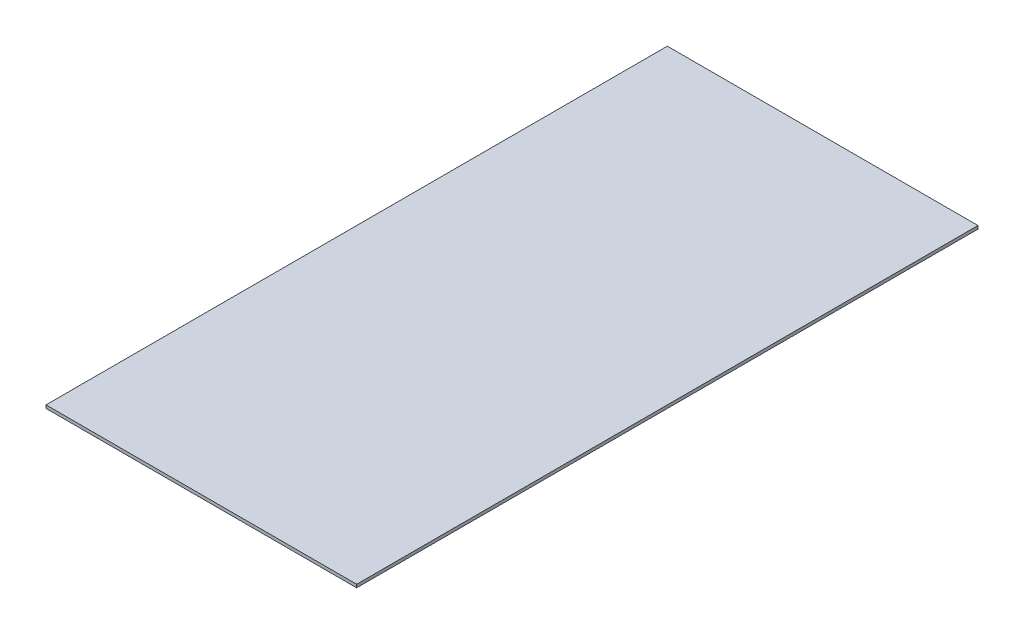
ISO-10303-21;
HEADER;
FILE_DESCRIPTION(('STEP AP214'),'2;1');
FILE_NAME('part.step','',(''),(''),'','','');
FILE_SCHEMA(('AUTOMOTIVE_DESIGN { 1 0 10303 214 1 1 1 1 }'));
ENDSEC;
DATA;
#1=APPLICATION_CONTEXT('core data for automotive mechanical design processes');
#2=APPLICATION_PROTOCOL_DEFINITION('international standard','automotive_design',2000,#1);
#3=PRODUCT_CONTEXT('',#1,'mechanical');
#4=PRODUCT('Part','Part','',(#3));
#5=PRODUCT_RELATED_PRODUCT_CATEGORY('part','',(#4));
#6=PRODUCT_DEFINITION_FORMATION('','',#4);
#7=PRODUCT_DEFINITION_CONTEXT('part definition',#1,'design');
#8=PRODUCT_DEFINITION('design','',#6,#7);
#9=PRODUCT_DEFINITION_SHAPE('','',#8);
#10=(LENGTH_UNIT() NAMED_UNIT(*) SI_UNIT(.MILLI.,.METRE.));
#11=(NAMED_UNIT(*) PLANE_ANGLE_UNIT() SI_UNIT($,.RADIAN.));
#12=(NAMED_UNIT(*) SI_UNIT($,.STERADIAN.) SOLID_ANGLE_UNIT());
#13=UNCERTAINTY_MEASURE_WITH_UNIT(LENGTH_MEASURE(1.E-05),#10,'distance_accuracy_value','');
#14=(GEOMETRIC_REPRESENTATION_CONTEXT(3) GLOBAL_UNCERTAINTY_ASSIGNED_CONTEXT((#13)) GLOBAL_UNIT_ASSIGNED_CONTEXT((#10,
#11,#12)) REPRESENTATION_CONTEXT('',''));
#15=CARTESIAN_POINT('',(0.,0.,0.));
#16=DIRECTION('',(0.,0.,1.));
#17=DIRECTION('',(1.,0.,0.));
#18=AXIS2_PLACEMENT_3D('',#15,#16,#17);
#19=CARTESIAN_POINT('',(-500.,-5.,1000.));
#20=DIRECTION('',(-1.,0.,0.));
#21=DIRECTION('',(0.,0.,1.));
#22=AXIS2_PLACEMENT_3D('',#19,#20,#21);
#23=PLANE('',#22);
#24=DIRECTION('',(0.,0.,1.));
#25=VECTOR('',#24,1.);
#26=CARTESIAN_POINT('',(-500.,5.,1000.));
#27=LINE('',#26,#25);
#28=CARTESIAN_POINT('',(-500.,5.,-1000.));
#29=VERTEX_POINT('',#28);
#30=CARTESIAN_POINT('',(-500.,5.,1000.));
#31=VERTEX_POINT('',#30);
#32=EDGE_CURVE('E97',#29,#31,#27,.T.);
#33=ORIENTED_EDGE('',*,*,#32,.F.);
#34=DIRECTION('',(0.,1.,0.));
#35=VECTOR('',#34,1.);
#36=CARTESIAN_POINT('',(-500.,-5.,-1000.));
#37=LINE('',#36,#35);
#38=CARTESIAN_POINT('',(-500.,-5.,-1000.));
#39=VERTEX_POINT('',#38);
#40=EDGE_CURVE('E11',#39,#29,#37,.T.);
#41=ORIENTED_EDGE('',*,*,#40,.F.);
#42=DIRECTION('',(0.,0.,1.));
#43=VECTOR('',#42,1.);
#44=CARTESIAN_POINT('',(-500.,-5.,1000.));
#45=LINE('',#44,#43);
#46=CARTESIAN_POINT('',(-500.,-5.,1000.));
#47=VERTEX_POINT('',#46);
#48=EDGE_CURVE('E91',#39,#47,#45,.T.);
#49=ORIENTED_EDGE('',*,*,#48,.T.);
#50=DIRECTION('',(0.,1.,0.));
#51=VECTOR('',#50,1.);
#52=CARTESIAN_POINT('',(-500.,-5.,1000.));
#53=LINE('',#52,#51);
#54=EDGE_CURVE('E36',#47,#31,#53,.T.);
#55=ORIENTED_EDGE('',*,*,#54,.T.);
#56=EDGE_LOOP('',(#33,#41,#49,#55));
#57=FACE_BOUND('',#56,.T.);
#58=ADVANCED_FACE('F33',(#57),#23,.T.);
#59=CARTESIAN_POINT('',(500.,-5.,-1000.));
#60=DIRECTION('',(0.,0.,-1.));
#61=DIRECTION('',(-1.,0.,0.));
#62=AXIS2_PLACEMENT_3D('',#59,#60,#61);
#63=PLANE('',#62);
#64=DIRECTION('',(-1.,0.,0.));
#65=VECTOR('',#64,1.);
#66=CARTESIAN_POINT('',(500.,5.,-1000.));
#67=LINE('',#66,#65);
#68=CARTESIAN_POINT('',(500.,5.,-1000.));
#69=VERTEX_POINT('',#68);
#70=EDGE_CURVE('E93',#69,#29,#67,.T.);
#71=ORIENTED_EDGE('',*,*,#70,.F.);
#72=DIRECTION('',(0.,1.,0.));
#73=VECTOR('',#72,1.);
#74=CARTESIAN_POINT('',(500.,-5.,-1000.));
#75=LINE('',#74,#73);
#76=CARTESIAN_POINT('',(500.,-5.,-1000.));
#77=VERTEX_POINT('',#76);
#78=EDGE_CURVE('E42',#77,#69,#75,.T.);
#79=ORIENTED_EDGE('',*,*,#78,.F.);
#80=DIRECTION('',(-1.,0.,0.));
#81=VECTOR('',#80,1.);
#82=CARTESIAN_POINT('',(500.,-5.,-1000.));
#83=LINE('',#82,#81);
#84=EDGE_CURVE('E88',#77,#39,#83,.T.);
#85=ORIENTED_EDGE('',*,*,#84,.T.);
#86=ORIENTED_EDGE('',*,*,#40,.T.);
#87=EDGE_LOOP('',(#71,#79,#85,#86));
#88=FACE_BOUND('',#87,.T.);
#89=ADVANCED_FACE('F107',(#88),#63,.T.);
#90=CARTESIAN_POINT('',(500.,-5.,1000.));
#91=DIRECTION('',(1.,0.,0.));
#92=DIRECTION('',(0.,0.,-1.));
#93=AXIS2_PLACEMENT_3D('',#90,#91,#92);
#94=PLANE('',#93);
#95=DIRECTION('',(0.,0.,-1.));
#96=VECTOR('',#95,1.);
#97=CARTESIAN_POINT('',(500.,5.,1000.));
#98=LINE('',#97,#96);
#99=CARTESIAN_POINT('',(500.,5.,1000.));
#100=VERTEX_POINT('',#99);
#101=EDGE_CURVE('E83',#100,#69,#98,.T.);
#102=ORIENTED_EDGE('',*,*,#101,.F.);
#103=DIRECTION('',(0.,1.,0.));
#104=VECTOR('',#103,1.);
#105=CARTESIAN_POINT('',(500.,-5.,1000.));
#106=LINE('',#105,#104);
#107=CARTESIAN_POINT('',(500.,-5.,1000.));
#108=VERTEX_POINT('',#107);
#109=EDGE_CURVE('E78',#108,#100,#106,.T.);
#110=ORIENTED_EDGE('',*,*,#109,.F.);
#111=DIRECTION('',(0.,0.,-1.));
#112=VECTOR('',#111,1.);
#113=CARTESIAN_POINT('',(500.,-5.,1000.));
#114=LINE('',#113,#112);
#115=EDGE_CURVE('E81',#108,#77,#114,.T.);
#116=ORIENTED_EDGE('',*,*,#115,.T.);
#117=ORIENTED_EDGE('',*,*,#78,.T.);
#118=EDGE_LOOP('',(#102,#110,#116,#117));
#119=FACE_BOUND('',#118,.T.);
#120=ADVANCED_FACE('F80',(#119),#94,.T.);
#121=CARTESIAN_POINT('',(500.,-5.,1000.));
#122=DIRECTION('',(0.,0.,1.));
#123=DIRECTION('',(1.,0.,0.));
#124=AXIS2_PLACEMENT_3D('',#121,#122,#123);
#125=PLANE('',#124);
#126=DIRECTION('',(1.,0.,0.));
#127=VECTOR('',#126,1.);
#128=CARTESIAN_POINT('',(500.,5.,1000.));
#129=LINE('',#128,#127);
#130=EDGE_CURVE('E100',#31,#100,#129,.T.);
#131=ORIENTED_EDGE('',*,*,#130,.F.);
#132=ORIENTED_EDGE('',*,*,#54,.F.);
#133=DIRECTION('',(1.,0.,0.));
#134=VECTOR('',#133,1.);
#135=CARTESIAN_POINT('',(500.,-5.,1000.));
#136=LINE('',#135,#134);
#137=EDGE_CURVE('E87',#47,#108,#136,.T.);
#138=ORIENTED_EDGE('',*,*,#137,.T.);
#139=ORIENTED_EDGE('',*,*,#109,.T.);
#140=EDGE_LOOP('',(#131,#132,#138,#139));
#141=FACE_BOUND('',#140,.T.);
#142=ADVANCED_FACE('F90',(#141),#125,.T.);
#143=CARTESIAN_POINT('',(0.,-5.,0.));
#144=DIRECTION('',(0.,1.,0.));
#145=DIRECTION('',(0.,0.,1.));
#146=AXIS2_PLACEMENT_3D('',#143,#144,#145);
#147=PLANE('',#146);
#148=ORIENTED_EDGE('',*,*,#48,.F.);
#149=ORIENTED_EDGE('',*,*,#84,.F.);
#150=ORIENTED_EDGE('',*,*,#115,.F.);
#151=ORIENTED_EDGE('',*,*,#137,.F.);
#152=EDGE_LOOP('',(#148,#149,#150,#151));
#153=FACE_BOUND('',#152,.T.);
#154=ADVANCED_FACE('F86',(#153),#147,.F.);
#155=CARTESIAN_POINT('',(0.,5.,0.));
#156=DIRECTION('',(0.,1.,0.));
#157=DIRECTION('',(0.,0.,1.));
#158=AXIS2_PLACEMENT_3D('',#155,#156,#157);
#159=PLANE('',#158);
#160=ORIENTED_EDGE('',*,*,#32,.T.);
#161=ORIENTED_EDGE('',*,*,#130,.T.);
#162=ORIENTED_EDGE('',*,*,#101,.T.);
#163=ORIENTED_EDGE('',*,*,#70,.T.);
#164=EDGE_LOOP('',(#160,#161,#162,#163));
#165=FACE_BOUND('',#164,.T.);
#166=ADVANCED_FACE('F106',(#165),#159,.T.);
#167=CLOSED_SHELL('',(#58,#89,#120,#142,#154,#166));
#168=MANIFOLD_SOLID_BREP('B2',#167);
#169=ADVANCED_BREP_SHAPE_REPRESENTATION('',(#18,#168),#14);
#170=SHAPE_DEFINITION_REPRESENTATION(#9,#169);
ENDSEC;
END-ISO-10303-21;
